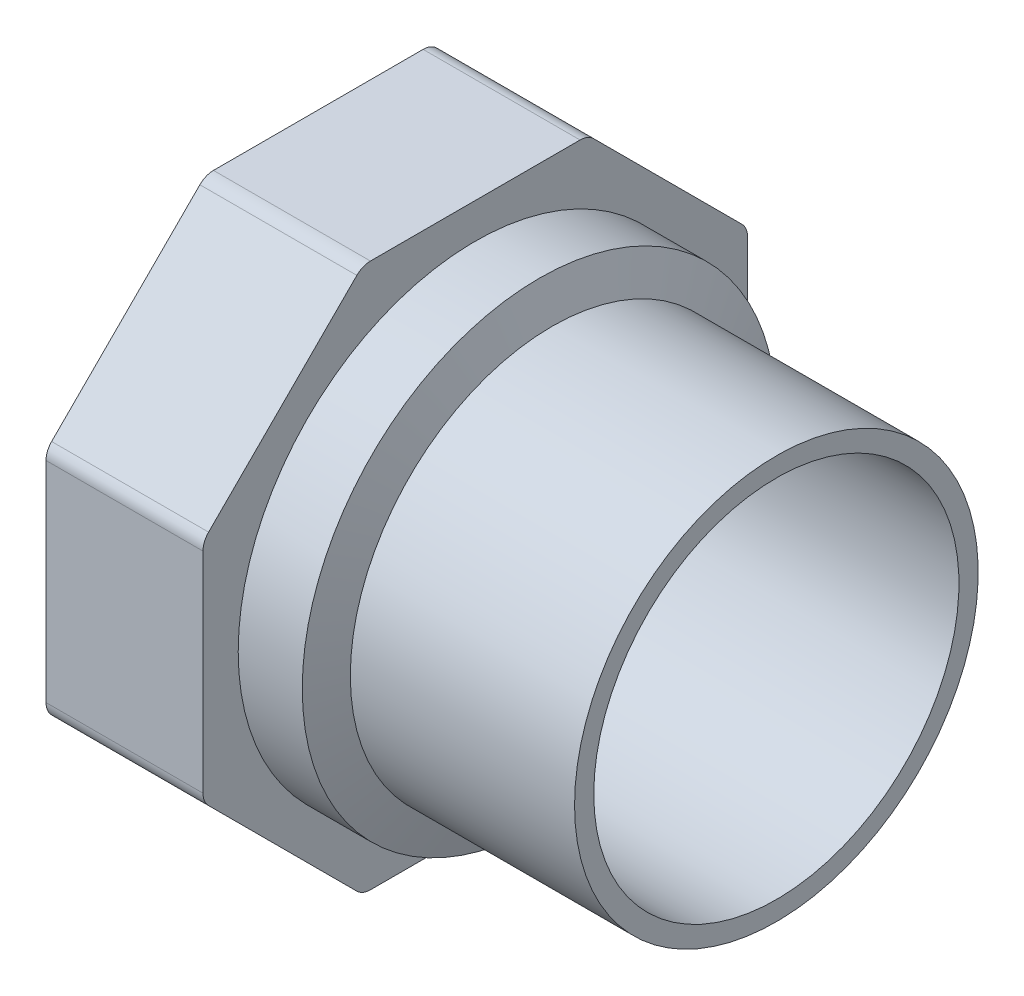
ISO-10303-21;
HEADER;
FILE_DESCRIPTION(('STEP AP214'),'2;1');
FILE_NAME('part.step','',(''),(''),'','','');
FILE_SCHEMA(('AUTOMOTIVE_DESIGN { 1 0 10303 214 1 1 1 1 }'));
ENDSEC;
DATA;
#1=APPLICATION_CONTEXT('core data for automotive mechanical design processes');
#2=APPLICATION_PROTOCOL_DEFINITION('international standard','automotive_design',2000,#1);
#3=PRODUCT_CONTEXT('',#1,'mechanical');
#4=PRODUCT('Part','Part','',(#3));
#5=PRODUCT_RELATED_PRODUCT_CATEGORY('part','',(#4));
#6=PRODUCT_DEFINITION_FORMATION('','',#4);
#7=PRODUCT_DEFINITION_CONTEXT('part definition',#1,'design');
#8=PRODUCT_DEFINITION('design','',#6,#7);
#9=PRODUCT_DEFINITION_SHAPE('','',#8);
#10=(LENGTH_UNIT() NAMED_UNIT(*) SI_UNIT(.MILLI.,.METRE.));
#11=(NAMED_UNIT(*) PLANE_ANGLE_UNIT() SI_UNIT($,.RADIAN.));
#12=(NAMED_UNIT(*) SI_UNIT($,.STERADIAN.) SOLID_ANGLE_UNIT());
#13=UNCERTAINTY_MEASURE_WITH_UNIT(LENGTH_MEASURE(1.E-05),#10,'distance_accuracy_value','');
#14=(GEOMETRIC_REPRESENTATION_CONTEXT(3) GLOBAL_UNCERTAINTY_ASSIGNED_CONTEXT((#13)) GLOBAL_UNIT_ASSIGNED_CONTEXT((#10,
#11,#12)) REPRESENTATION_CONTEXT('',''));
#15=CARTESIAN_POINT('',(0.,0.,0.));
#16=DIRECTION('',(0.,0.,1.));
#17=DIRECTION('',(1.,0.,0.));
#18=AXIS2_PLACEMENT_3D('',#15,#16,#17);
#19=CARTESIAN_POINT('',(-35.,0.,0.));
#20=DIRECTION('',(-1.,0.,0.));
#21=DIRECTION('',(0.,0.,1.));
#22=AXIS2_PLACEMENT_3D('',#19,#20,#21);
#23=CYLINDRICAL_SURFACE('',#22,31.5);
#24=CARTESIAN_POINT('',(-35.,0.,0.));
#25=DIRECTION('',(1.,0.,0.));
#26=DIRECTION('',(0.,1.,0.));
#27=AXIS2_PLACEMENT_3D('',#24,#25,#26);
#28=CIRCLE('',#27,31.5);
#29=CARTESIAN_POINT('',(-35.,31.5,0.));
#30=VERTEX_POINT('',#29);
#31=EDGE_CURVE('E193',#30,#30,#28,.F.);
#32=ORIENTED_EDGE('',*,*,#31,.F.);
#33=EDGE_LOOP('',(#32));
#34=FACE_BOUND('',#33,.T.);
#35=CARTESIAN_POINT('',(0.,0.,0.));
#36=DIRECTION('',(-1.,0.,0.));
#37=DIRECTION('',(0.,0.,1.));
#38=AXIS2_PLACEMENT_3D('',#35,#36,#37);
#39=CIRCLE('',#38,31.5);
#40=CARTESIAN_POINT('',(0.,0.,31.5));
#41=VERTEX_POINT('',#40);
#42=EDGE_CURVE('E18',#41,#41,#39,.F.);
#43=ORIENTED_EDGE('',*,*,#42,.F.);
#44=EDGE_LOOP('',(#43));
#45=FACE_BOUND('',#44,.T.);
#46=ADVANCED_FACE('F15',(#34,#45),#23,.T.);
#47=CARTESIAN_POINT('',(-35.,0.,0.));
#48=DIRECTION('',(-1.,0.,0.));
#49=DIRECTION('',(0.,0.,1.));
#50=AXIS2_PLACEMENT_3D('',#47,#48,#49);
#51=CONICAL_SURFACE('',#50,31.5,1.22202532321099);
#52=CARTESIAN_POINT('',(-37.,0.,0.));
#53=DIRECTION('',(-1.,0.,0.));
#54=DIRECTION('',(0.,1.,0.));
#55=AXIS2_PLACEMENT_3D('',#52,#53,#54);
#56=CIRCLE('',#55,37.);
#57=CARTESIAN_POINT('',(-37.,37.,0.));
#58=VERTEX_POINT('',#57);
#59=EDGE_CURVE('E189',#58,#58,#56,.T.);
#60=ORIENTED_EDGE('',*,*,#59,.F.);
#61=EDGE_LOOP('',(#60));
#62=FACE_BOUND('',#61,.T.);
#63=ORIENTED_EDGE('',*,*,#31,.T.);
#64=EDGE_LOOP('',(#63));
#65=FACE_BOUND('',#64,.T.);
#66=ADVANCED_FACE('F268',(#62,#65),#51,.T.);
#67=CARTESIAN_POINT('',(0.,31.5,31.8780010540613));
#68=DIRECTION('',(1.,0.,0.));
#69=DIRECTION('',(0.,-1.,0.));
#70=AXIS2_PLACEMENT_3D('',#67,#68,#69);
#71=PLANE('',#70);
#72=CARTESIAN_POINT('',(0.,0.,0.));
#73=DIRECTION('',(-1.,0.,0.));
#74=DIRECTION('',(0.,0.,1.));
#75=AXIS2_PLACEMENT_3D('',#72,#73,#74);
#76=CIRCLE('',#75,28.5);
#77=CARTESIAN_POINT('',(0.,0.,28.5));
#78=VERTEX_POINT('',#77);
#79=EDGE_CURVE('E192',#78,#78,#76,.F.);
#80=ORIENTED_EDGE('',*,*,#79,.F.);
#81=EDGE_LOOP('',(#80));
#82=FACE_BOUND('',#81,.T.);
#83=ORIENTED_EDGE('',*,*,#42,.T.);
#84=EDGE_LOOP('',(#83));
#85=FACE_BOUND('',#84,.T.);
#86=ADVANCED_FACE('F264',(#82,#85),#71,.T.);
#87=CARTESIAN_POINT('',(-47.,0.,0.));
#88=DIRECTION('',(-1.,0.,0.));
#89=DIRECTION('',(0.,0.,1.));
#90=AXIS2_PLACEMENT_3D('',#87,#88,#89);
#91=CYLINDRICAL_SURFACE('',#90,37.);
#92=CARTESIAN_POINT('',(-47.,0.,0.));
#93=DIRECTION('',(-1.,0.,0.));
#94=DIRECTION('',(0.,0.,1.));
#95=AXIS2_PLACEMENT_3D('',#92,#93,#94);
#96=CIRCLE('',#95,37.);
#97=CARTESIAN_POINT('',(-47.,0.,37.));
#98=VERTEX_POINT('',#97);
#99=EDGE_CURVE('E188',#98,#98,#96,.T.);
#100=ORIENTED_EDGE('',*,*,#99,.F.);
#101=EDGE_LOOP('',(#100));
#102=FACE_BOUND('',#101,.T.);
#103=ORIENTED_EDGE('',*,*,#59,.T.);
#104=EDGE_LOOP('',(#103));
#105=FACE_BOUND('',#104,.T.);
#106=ADVANCED_FACE('F267',(#102,#105),#91,.T.);
#107=CARTESIAN_POINT('',(0.,0.,0.));
#108=DIRECTION('',(-1.,0.,0.));
#109=DIRECTION('',(0.,0.,1.));
#110=AXIS2_PLACEMENT_3D('',#107,#108,#109);
#111=CYLINDRICAL_SURFACE('',#110,28.5);
#112=ORIENTED_EDGE('',*,*,#79,.T.);
#113=EDGE_LOOP('',(#112));
#114=FACE_BOUND('',#113,.T.);
#115=CARTESIAN_POINT('',(-47.7694157147741,0.,0.));
#116=DIRECTION('',(1.,0.,0.));
#117=DIRECTION('',(0.,1.,0.));
#118=AXIS2_PLACEMENT_3D('',#115,#116,#117);
#119=CIRCLE('',#118,28.5);
#120=CARTESIAN_POINT('',(-47.7694157147741,28.5,0.));
#121=VERTEX_POINT('',#120);
#122=EDGE_CURVE('E135',#121,#121,#119,.T.);
#123=ORIENTED_EDGE('',*,*,#122,.F.);
#124=EDGE_LOOP('',(#123));
#125=FACE_BOUND('',#124,.T.);
#126=ADVANCED_FACE('F261',(#114,#125),#111,.F.);
#127=CARTESIAN_POINT('',(-47.,42.5,42.5));
#128=DIRECTION('',(1.,0.,0.));
#129=DIRECTION('',(0.,-1.,0.));
#130=AXIS2_PLACEMENT_3D('',#127,#128,#129);
#131=PLANE('',#130);
#132=ORIENTED_EDGE('',*,*,#99,.T.);
#133=EDGE_LOOP('',(#132));
#134=FACE_BOUND('',#133,.T.);
#135=CARTESIAN_POINT('',(-47.,16.3614357137373,39.5));
#136=DIRECTION('',(1.,0.,0.));
#137=DIRECTION('',(0.,0.,-1.));
#138=AXIS2_PLACEMENT_3D('',#135,#136,#137);
#139=CIRCLE('',#138,3.00000000000001);
#140=CARTESIAN_POINT('',(-47.,16.3614357137373,42.5));
#141=VERTEX_POINT('',#140);
#142=CARTESIAN_POINT('',(-47.,18.4827560572969,41.6213203435597));
#143=VERTEX_POINT('',#142);
#144=EDGE_CURVE('E254',#141,#143,#139,.F.);
#145=ORIENTED_EDGE('',*,*,#144,.F.);
#146=DIRECTION('',(0.,1.,0.));
#147=VECTOR('',#146,1.);
#148=CARTESIAN_POINT('',(-47.,0.,42.5));
#149=LINE('',#148,#147);
#150=CARTESIAN_POINT('',(-47.,-16.3614357137373,42.5));
#151=VERTEX_POINT('',#150);
#152=EDGE_CURVE('E132',#151,#141,#149,.T.);
#153=ORIENTED_EDGE('',*,*,#152,.F.);
#154=CARTESIAN_POINT('',(-47.,-16.3614357137373,39.5));
#155=DIRECTION('',(1.,0.,0.));
#156=DIRECTION('',(0.,0.,-1.));
#157=AXIS2_PLACEMENT_3D('',#154,#155,#156);
#158=CIRCLE('',#157,3.00000000000002);
#159=CARTESIAN_POINT('',(-47.,-18.4827560572969,41.6213203435597));
#160=VERTEX_POINT('',#159);
#161=EDGE_CURVE('E126',#160,#151,#158,.F.);
#162=ORIENTED_EDGE('',*,*,#161,.F.);
#163=DIRECTION('',(0.,0.707106781186547,0.707106781186548));
#164=VECTOR('',#163,1.);
#165=CARTESIAN_POINT('',(-47.,-30.0520382004283,30.0520382004283));
#166=LINE('',#165,#164);
#167=CARTESIAN_POINT('',(-47.,-41.6213203435597,18.4827560572969));
#168=VERTEX_POINT('',#167);
#169=EDGE_CURVE('E130',#168,#160,#166,.T.);
#170=ORIENTED_EDGE('',*,*,#169,.F.);
#171=CARTESIAN_POINT('',(-47.,-39.5,16.3614357137372));
#172=DIRECTION('',(1.,0.,0.));
#173=DIRECTION('',(0.,0.,-1.));
#174=AXIS2_PLACEMENT_3D('',#171,#172,#173);
#175=CIRCLE('',#174,2.99999999999999);
#176=CARTESIAN_POINT('',(-47.,-42.5,16.3614357137372));
#177=VERTEX_POINT('',#176);
#178=EDGE_CURVE('E149',#177,#168,#175,.F.);
#179=ORIENTED_EDGE('',*,*,#178,.F.);
#180=DIRECTION('',(0.,0.,1.));
#181=VECTOR('',#180,1.);
#182=CARTESIAN_POINT('',(-47.,-42.5,0.));
#183=LINE('',#182,#181);
#184=CARTESIAN_POINT('',(-47.,-42.5,-16.3614357137373));
#185=VERTEX_POINT('',#184);
#186=EDGE_CURVE('E154',#185,#177,#183,.T.);
#187=ORIENTED_EDGE('',*,*,#186,.F.);
#188=CARTESIAN_POINT('',(-47.,-39.4999999999999,-16.3614357137373));
#189=DIRECTION('',(1.,0.,0.));
#190=DIRECTION('',(0.,0.,-1.));
#191=AXIS2_PLACEMENT_3D('',#188,#189,#190);
#192=CIRCLE('',#191,3.00000000000007);
#193=CARTESIAN_POINT('',(-47.,-41.6213203435596,-18.4827560572969));
#194=VERTEX_POINT('',#193);
#195=EDGE_CURVE('E239',#194,#185,#192,.F.);
#196=ORIENTED_EDGE('',*,*,#195,.F.);
#197=DIRECTION('',(0.,-0.707106781186548,0.707106781186547));
#198=VECTOR('',#197,1.);
#199=CARTESIAN_POINT('',(-47.,-30.0520382004283,-30.0520382004283));
#200=LINE('',#199,#198);
#201=CARTESIAN_POINT('',(-47.,-18.4827560572969,-41.6213203435597));
#202=VERTEX_POINT('',#201);
#203=EDGE_CURVE('E159',#202,#194,#200,.T.);
#204=ORIENTED_EDGE('',*,*,#203,.F.);
#205=CARTESIAN_POINT('',(-47.,-16.3614357137372,-39.5));
#206=DIRECTION('',(1.,0.,0.));
#207=DIRECTION('',(0.,0.,-1.));
#208=AXIS2_PLACEMENT_3D('',#205,#206,#207);
#209=CIRCLE('',#208,2.99999999999999);
#210=CARTESIAN_POINT('',(-47.,-16.3614357137372,-42.5));
#211=VERTEX_POINT('',#210);
#212=EDGE_CURVE('E242',#211,#202,#209,.F.);
#213=ORIENTED_EDGE('',*,*,#212,.F.);
#214=DIRECTION('',(0.,-1.,0.));
#215=VECTOR('',#214,1.);
#216=CARTESIAN_POINT('',(-47.,0.,-42.5));
#217=LINE('',#216,#215);
#218=CARTESIAN_POINT('',(-47.,16.3614357137373,-42.5));
#219=VERTEX_POINT('',#218);
#220=EDGE_CURVE('E164',#219,#211,#217,.T.);
#221=ORIENTED_EDGE('',*,*,#220,.F.);
#222=CARTESIAN_POINT('',(-47.,16.3614357137373,-39.5));
#223=DIRECTION('',(1.,0.,0.));
#224=DIRECTION('',(0.,0.,-1.));
#225=AXIS2_PLACEMENT_3D('',#222,#223,#224);
#226=CIRCLE('',#225,3.);
#227=CARTESIAN_POINT('',(-47.,18.4827560572969,-41.6213203435596));
#228=VERTEX_POINT('',#227);
#229=EDGE_CURVE('E245',#228,#219,#226,.F.);
#230=ORIENTED_EDGE('',*,*,#229,.F.);
#231=DIRECTION('',(0.,-0.707106781186547,-0.707106781186548));
#232=VECTOR('',#231,1.);
#233=CARTESIAN_POINT('',(-47.,30.0520382004283,-30.0520382004283));
#234=LINE('',#233,#232);
#235=CARTESIAN_POINT('',(-47.,41.6213203435597,-18.4827560572969));
#236=VERTEX_POINT('',#235);
#237=EDGE_CURVE('E169',#236,#228,#234,.T.);
#238=ORIENTED_EDGE('',*,*,#237,.F.);
#239=CARTESIAN_POINT('',(-47.,39.5,-16.3614357137372));
#240=DIRECTION('',(1.,0.,0.));
#241=DIRECTION('',(0.,0.,-1.));
#242=AXIS2_PLACEMENT_3D('',#239,#240,#241);
#243=CIRCLE('',#242,3.00000000000005);
#244=CARTESIAN_POINT('',(-47.,42.5,-16.3614357137372));
#245=VERTEX_POINT('',#244);
#246=EDGE_CURVE('E248',#245,#236,#243,.F.);
#247=ORIENTED_EDGE('',*,*,#246,.F.);
#248=DIRECTION('',(0.,0.,-1.));
#249=VECTOR('',#248,1.);
#250=CARTESIAN_POINT('',(-47.,42.5,0.));
#251=LINE('',#250,#249);
#252=CARTESIAN_POINT('',(-47.,42.5,16.3614357137372));
#253=VERTEX_POINT('',#252);
#254=EDGE_CURVE('E174',#253,#245,#251,.T.);
#255=ORIENTED_EDGE('',*,*,#254,.F.);
#256=CARTESIAN_POINT('',(-47.,39.5,16.3614357137372));
#257=DIRECTION('',(1.,0.,0.));
#258=DIRECTION('',(0.,0.,-1.));
#259=AXIS2_PLACEMENT_3D('',#256,#257,#258);
#260=CIRCLE('',#259,3.00000000000004);
#261=CARTESIAN_POINT('',(-47.,41.6213203435597,18.4827560572969));
#262=VERTEX_POINT('',#261);
#263=EDGE_CURVE('E251',#262,#253,#260,.F.);
#264=ORIENTED_EDGE('',*,*,#263,.F.);
#265=DIRECTION('',(0.,0.707106781186548,-0.707106781186548));
#266=VECTOR('',#265,1.);
#267=CARTESIAN_POINT('',(-47.,30.0520382004283,30.0520382004283));
#268=LINE('',#267,#266);
#269=EDGE_CURVE('E179',#143,#262,#268,.T.);
#270=ORIENTED_EDGE('',*,*,#269,.F.);
#271=EDGE_LOOP('',(#145,#153,#162,#170,#179,#187,#196,#204,#213,#221,#230,#238,#247,#255,#264,#270));
#272=FACE_BOUND('',#271,.T.);
#273=ADVANCED_FACE('F128',(#134,#272),#131,.T.);
#274=CARTESIAN_POINT('',(-47.,0.,0.));
#275=DIRECTION('',(-1.,0.,0.));
#276=DIRECTION('',(0.,0.,1.));
#277=AXIS2_PLACEMENT_3D('',#274,#275,#276);
#278=CONICAL_SURFACE('',#277,27.1673328898693,1.04719755119659);
#279=ORIENTED_EDGE('',*,*,#122,.T.);
#280=EDGE_LOOP('',(#279));
#281=FACE_BOUND('',#280,.T.);
#282=CARTESIAN_POINT('',(-47.,0.,0.));
#283=DIRECTION('',(1.,0.,0.));
#284=DIRECTION('',(0.,1.,0.));
#285=AXIS2_PLACEMENT_3D('',#282,#283,#284);
#286=CIRCLE('',#285,27.1673328898693);
#287=CARTESIAN_POINT('',(-47.,27.1673328898693,0.));
#288=VERTEX_POINT('',#287);
#289=EDGE_CURVE('E153',#288,#288,#286,.T.);
#290=ORIENTED_EDGE('',*,*,#289,.F.);
#291=EDGE_LOOP('',(#290));
#292=FACE_BOUND('',#291,.T.);
#293=ADVANCED_FACE('F438',(#281,#292),#278,.T.);
#294=CARTESIAN_POINT('',(-47.,-16.3614357137373,39.5));
#295=DIRECTION('',(1.,0.,0.));
#296=DIRECTION('',(0.,0.,-1.));
#297=AXIS2_PLACEMENT_3D('',#294,#295,#296);
#298=CYLINDRICAL_SURFACE('',#297,3.00000000000002);
#299=CARTESIAN_POINT('',(-71.5,-16.3614357137373,39.5));
#300=DIRECTION('',(1.,0.,0.));
#301=DIRECTION('',(0.,0.,-1.));
#302=AXIS2_PLACEMENT_3D('',#299,#300,#301);
#303=CIRCLE('',#302,3.00000000000002);
#304=CARTESIAN_POINT('',(-71.5,-18.4827560572969,41.6213203435597));
#305=VERTEX_POINT('',#304);
#306=CARTESIAN_POINT('',(-71.5,-16.3614357137373,42.5));
#307=VERTEX_POINT('',#306);
#308=EDGE_CURVE('E141',#305,#307,#303,.F.);
#309=ORIENTED_EDGE('',*,*,#308,.F.);
#310=DIRECTION('',(1.,0.,0.));
#311=VECTOR('',#310,1.);
#312=CARTESIAN_POINT('',(-71.5,-18.4827560572969,41.6213203435597));
#313=LINE('',#312,#311);
#314=EDGE_CURVE('E138',#160,#305,#313,.F.);
#315=ORIENTED_EDGE('',*,*,#314,.F.);
#316=ORIENTED_EDGE('',*,*,#161,.T.);
#317=DIRECTION('',(1.,0.,0.));
#318=VECTOR('',#317,1.);
#319=CARTESIAN_POINT('',(-71.5,-16.3614357137373,42.5));
#320=LINE('',#319,#318);
#321=EDGE_CURVE('E185',#307,#151,#320,.T.);
#322=ORIENTED_EDGE('',*,*,#321,.F.);
#323=EDGE_LOOP('',(#309,#315,#316,#322));
#324=FACE_BOUND('',#323,.T.);
#325=ADVANCED_FACE('F139',(#324),#298,.T.);
#326=CARTESIAN_POINT('',(-71.5,16.3614357137372,42.5));
#327=DIRECTION('',(0.,0.,1.));
#328=DIRECTION('',(0.,-1.,0.));
#329=AXIS2_PLACEMENT_3D('',#326,#327,#328);
#330=PLANE('',#329);
#331=DIRECTION('',(0.,1.,0.));
#332=VECTOR('',#331,1.);
#333=CARTESIAN_POINT('',(-71.5,0.,42.5));
#334=LINE('',#333,#332);
#335=CARTESIAN_POINT('',(-71.5,16.3614357137373,42.5));
#336=VERTEX_POINT('',#335);
#337=EDGE_CURVE('E236',#307,#336,#334,.T.);
#338=ORIENTED_EDGE('',*,*,#337,.F.);
#339=ORIENTED_EDGE('',*,*,#321,.T.);
#340=ORIENTED_EDGE('',*,*,#152,.T.);
#341=DIRECTION('',(1.,0.,0.));
#342=VECTOR('',#341,1.);
#343=CARTESIAN_POINT('',(-59.25,16.3614357137372,42.5));
#344=LINE('',#343,#342);
#345=EDGE_CURVE('E183',#336,#141,#344,.T.);
#346=ORIENTED_EDGE('',*,*,#345,.F.);
#347=EDGE_LOOP('',(#338,#339,#340,#346));
#348=FACE_BOUND('',#347,.T.);
#349=ADVANCED_FACE('F387',(#348),#330,.T.);
#350=CARTESIAN_POINT('',(-47.,16.3614357137373,39.5));
#351=DIRECTION('',(1.,0.,0.));
#352=DIRECTION('',(0.,0.,-1.));
#353=AXIS2_PLACEMENT_3D('',#350,#351,#352);
#354=CYLINDRICAL_SURFACE('',#353,3.00000000000001);
#355=CARTESIAN_POINT('',(-71.5,16.3614357137373,39.5));
#356=DIRECTION('',(1.,0.,0.));
#357=DIRECTION('',(0.,0.,-1.));
#358=AXIS2_PLACEMENT_3D('',#355,#356,#357);
#359=CIRCLE('',#358,3.00000000000001);
#360=CARTESIAN_POINT('',(-71.5,18.4827560572969,41.6213203435597));
#361=VERTEX_POINT('',#360);
#362=EDGE_CURVE('E233',#336,#361,#359,.F.);
#363=ORIENTED_EDGE('',*,*,#362,.F.);
#364=ORIENTED_EDGE('',*,*,#345,.T.);
#365=ORIENTED_EDGE('',*,*,#144,.T.);
#366=DIRECTION('',(1.,0.,0.));
#367=VECTOR('',#366,1.);
#368=CARTESIAN_POINT('',(-71.5,18.4827560572969,41.6213203435597));
#369=LINE('',#368,#367);
#370=EDGE_CURVE('E182',#361,#143,#369,.T.);
#371=ORIENTED_EDGE('',*,*,#370,.F.);
#372=EDGE_LOOP('',(#363,#364,#365,#371));
#373=FACE_BOUND('',#372,.T.);
#374=ADVANCED_FACE('F425',(#373),#354,.T.);
#375=CARTESIAN_POINT('',(-71.5,41.6213203435597,18.4827560572969));
#376=DIRECTION('',(0.,0.707106781186547,0.707106781186547));
#377=DIRECTION('',(0.,-0.707106781186547,0.707106781186547));
#378=AXIS2_PLACEMENT_3D('',#375,#376,#377);
#379=PLANE('',#378);
#380=CARTESIAN_POINT('',(-71.5,18.4827560572969,41.6213203435597));
#381=CARTESIAN_POINT('',(-71.5,19.4468629025579,40.6572134982987));
#382=CARTESIAN_POINT('',(-71.5,20.4109697478188,39.6931066530378));
#383=CARTESIAN_POINT('',(-71.5,22.3391834383407,37.7648929625159));
#384=CARTESIAN_POINT('',(-71.5,23.3032902836016,36.8007861172549));
#385=CARTESIAN_POINT('',(-71.5,25.2315039741235,34.872572426733));
#386=CARTESIAN_POINT('',(-71.5,26.1956108193845,33.9084655814721));
#387=CARTESIAN_POINT('',(-71.5,28.1238245099064,31.9802518909502));
#388=CARTESIAN_POINT('',(-71.5,29.0879313551673,31.0161450456892));
#389=CARTESIAN_POINT('',(-71.5,31.0161450456892,29.0879313551673));
#390=CARTESIAN_POINT('',(-71.5,31.9802518909502,28.1238245099064));
#391=CARTESIAN_POINT('',(-71.5,33.9084655814721,26.1956108193845));
#392=CARTESIAN_POINT('',(-71.5,34.872572426733,25.2315039741235));
#393=CARTESIAN_POINT('',(-71.5,36.8007861172549,23.3032902836016));
#394=CARTESIAN_POINT('',(-71.5,37.7648929625159,22.3391834383407));
#395=CARTESIAN_POINT('',(-71.5,39.6931066530378,20.4109697478188));
#396=CARTESIAN_POINT('',(-71.5,40.6572134982987,19.4468629025578));
#397=CARTESIAN_POINT('',(-71.5,41.6213203435597,18.4827560572969));
#398=B_SPLINE_CURVE_WITH_KNOTS('',3,(#380,#381,#382,#383,#384,#385,#386,#387,#388,#389,#390,
#391,#392,#393,#394,#395,#396,#397),.UNSPECIFIED.,.F.,.F.,(4,2,2,2,2,2,2,2,4),(0.,
4.09035892843431,8.18071785686863,12.271076785303,16.3614357137373,20.4517946421716,
24.5421535706059,28.6325124990402,32.7228714274745),.UNSPECIFIED.);
#399=CARTESIAN_POINT('',(-71.5,41.6213203435597,18.4827560572969));
#400=VERTEX_POINT('',#399);
#401=EDGE_CURVE('E232',#361,#400,#398,.T.);
#402=ORIENTED_EDGE('',*,*,#401,.F.);
#403=ORIENTED_EDGE('',*,*,#370,.T.);
#404=ORIENTED_EDGE('',*,*,#269,.T.);
#405=DIRECTION('',(1.,0.,0.));
#406=VECTOR('',#405,1.);
#407=CARTESIAN_POINT('',(-59.25,41.6213203435597,18.4827560572969));
#408=LINE('',#407,#406);
#409=EDGE_CURVE('E178',#400,#262,#408,.T.);
#410=ORIENTED_EDGE('',*,*,#409,.F.);
#411=EDGE_LOOP('',(#402,#403,#404,#410));
#412=FACE_BOUND('',#411,.T.);
#413=ADVANCED_FACE('F423',(#412),#379,.T.);
#414=CARTESIAN_POINT('',(-47.,39.5,16.3614357137372));
#415=DIRECTION('',(1.,0.,0.));
#416=DIRECTION('',(0.,0.,-1.));
#417=AXIS2_PLACEMENT_3D('',#414,#415,#416);
#418=CYLINDRICAL_SURFACE('',#417,3.00000000000004);
#419=CARTESIAN_POINT('',(-71.5,39.5,16.3614357137372));
#420=DIRECTION('',(1.,0.,0.));
#421=DIRECTION('',(0.,0.,-1.));
#422=AXIS2_PLACEMENT_3D('',#419,#420,#421);
#423=CIRCLE('',#422,3.00000000000004);
#424=CARTESIAN_POINT('',(-71.5,42.5,16.3614357137372));
#425=VERTEX_POINT('',#424);
#426=EDGE_CURVE('E229',#400,#425,#423,.F.);
#427=ORIENTED_EDGE('',*,*,#426,.F.);
#428=ORIENTED_EDGE('',*,*,#409,.T.);
#429=ORIENTED_EDGE('',*,*,#263,.T.);
#430=DIRECTION('',(1.,0.,0.));
#431=VECTOR('',#430,1.);
#432=CARTESIAN_POINT('',(-71.5,42.5,16.3614357137373));
#433=LINE('',#432,#431);
#434=EDGE_CURVE('E177',#425,#253,#433,.T.);
#435=ORIENTED_EDGE('',*,*,#434,.F.);
#436=EDGE_LOOP('',(#427,#428,#429,#435));
#437=FACE_BOUND('',#436,.T.);
#438=ADVANCED_FACE('F420',(#437),#418,.T.);
#439=CARTESIAN_POINT('',(-71.5,42.5,-16.3614357137372));
#440=DIRECTION('',(0.,1.,0.));
#441=DIRECTION('',(0.,0.,1.));
#442=AXIS2_PLACEMENT_3D('',#439,#440,#441);
#443=PLANE('',#442);
#444=DIRECTION('',(0.,0.,-1.));
#445=VECTOR('',#444,1.);
#446=CARTESIAN_POINT('',(-71.5,42.5,42.5));
#447=LINE('',#446,#445);
#448=CARTESIAN_POINT('',(-71.5,42.5,-16.3614357137372));
#449=VERTEX_POINT('',#448);
#450=EDGE_CURVE('E228',#425,#449,#447,.T.);
#451=ORIENTED_EDGE('',*,*,#450,.F.);
#452=ORIENTED_EDGE('',*,*,#434,.T.);
#453=ORIENTED_EDGE('',*,*,#254,.T.);
#454=DIRECTION('',(1.,0.,0.));
#455=VECTOR('',#454,1.);
#456=CARTESIAN_POINT('',(-59.25,42.5,-16.3614357137372));
#457=LINE('',#456,#455);
#458=EDGE_CURVE('E173',#449,#245,#457,.T.);
#459=ORIENTED_EDGE('',*,*,#458,.F.);
#460=EDGE_LOOP('',(#451,#452,#453,#459));
#461=FACE_BOUND('',#460,.T.);
#462=ADVANCED_FACE('F417',(#461),#443,.T.);
#463=CARTESIAN_POINT('',(-47.,39.5,-16.3614357137372));
#464=DIRECTION('',(1.,0.,0.));
#465=DIRECTION('',(0.,0.,-1.));
#466=AXIS2_PLACEMENT_3D('',#463,#464,#465);
#467=CYLINDRICAL_SURFACE('',#466,3.00000000000005);
#468=CARTESIAN_POINT('',(-71.5,39.5,-16.3614357137372));
#469=DIRECTION('',(1.,0.,0.));
#470=DIRECTION('',(0.,0.,-1.));
#471=AXIS2_PLACEMENT_3D('',#468,#469,#470);
#472=CIRCLE('',#471,3.00000000000005);
#473=CARTESIAN_POINT('',(-71.5,41.6213203435597,-18.4827560572969));
#474=VERTEX_POINT('',#473);
#475=EDGE_CURVE('E225',#449,#474,#472,.F.);
#476=ORIENTED_EDGE('',*,*,#475,.F.);
#477=ORIENTED_EDGE('',*,*,#458,.T.);
#478=ORIENTED_EDGE('',*,*,#246,.T.);
#479=DIRECTION('',(1.,0.,0.));
#480=VECTOR('',#479,1.);
#481=CARTESIAN_POINT('',(-71.5,41.6213203435597,-18.4827560572969));
#482=LINE('',#481,#480);
#483=EDGE_CURVE('E172',#474,#236,#482,.T.);
#484=ORIENTED_EDGE('',*,*,#483,.F.);
#485=EDGE_LOOP('',(#476,#477,#478,#484));
#486=FACE_BOUND('',#485,.T.);
#487=ADVANCED_FACE('F414',(#486),#467,.T.);
#488=CARTESIAN_POINT('',(-71.5,18.4827560572969,-41.6213203435596));
#489=DIRECTION('',(0.,0.707106781186548,-0.707106781186547));
#490=DIRECTION('',(0.,0.707106781186547,0.707106781186548));
#491=AXIS2_PLACEMENT_3D('',#488,#489,#490);
#492=PLANE('',#491);
#493=CARTESIAN_POINT('',(-71.5,41.6213203435597,-18.4827560572969));
#494=CARTESIAN_POINT('',(-71.5,40.6572134982987,-19.4468629025578));
#495=CARTESIAN_POINT('',(-71.5,39.6931066530378,-20.4109697478188));
#496=CARTESIAN_POINT('',(-71.5,37.7648929625159,-22.3391834383407));
#497=CARTESIAN_POINT('',(-71.5,36.8007861172549,-23.3032902836016));
#498=CARTESIAN_POINT('',(-71.5,34.872572426733,-25.2315039741235));
#499=CARTESIAN_POINT('',(-71.5,33.9084655814721,-26.1956108193845));
#500=CARTESIAN_POINT('',(-71.5,31.9802518909502,-28.1238245099064));
#501=CARTESIAN_POINT('',(-71.5,31.0161450456892,-29.0879313551673));
#502=CARTESIAN_POINT('',(-71.5,29.0879313551673,-31.0161450456892));
#503=CARTESIAN_POINT('',(-71.5,28.1238245099064,-31.9802518909502));
#504=CARTESIAN_POINT('',(-71.5,26.1956108193845,-33.9084655814721));
#505=CARTESIAN_POINT('',(-71.5,25.2315039741235,-34.872572426733));
#506=CARTESIAN_POINT('',(-71.5,23.3032902836016,-36.8007861172549));
#507=CARTESIAN_POINT('',(-71.5,22.3391834383407,-37.7648929625158));
#508=CARTESIAN_POINT('',(-71.5,20.4109697478188,-39.6931066530377));
#509=CARTESIAN_POINT('',(-71.5,19.4468629025579,-40.6572134982987));
#510=CARTESIAN_POINT('',(-71.5,18.4827560572969,-41.6213203435596));
#511=B_SPLINE_CURVE_WITH_KNOTS('',3,(#493,#494,#495,#496,#497,#498,#499,#500,#501,#502,#503,
#504,#505,#506,#507,#508,#509,#510),.UNSPECIFIED.,.F.,.F.,(4,2,2,2,2,2,2,2,4),(0.,
4.09035892843432,8.18071785686863,12.2710767853029,16.3614357137373,20.4517946421716,
24.5421535706059,28.6325124990402,32.7228714274745),.UNSPECIFIED.);
#512=CARTESIAN_POINT('',(-71.5,18.4827560572969,-41.6213203435596));
#513=VERTEX_POINT('',#512);
#514=EDGE_CURVE('E224',#474,#513,#511,.T.);
#515=ORIENTED_EDGE('',*,*,#514,.F.);
#516=ORIENTED_EDGE('',*,*,#483,.T.);
#517=ORIENTED_EDGE('',*,*,#237,.T.);
#518=DIRECTION('',(1.,0.,0.));
#519=VECTOR('',#518,1.);
#520=CARTESIAN_POINT('',(-59.25,18.4827560572969,-41.6213203435596));
#521=LINE('',#520,#519);
#522=EDGE_CURVE('E168',#513,#228,#521,.T.);
#523=ORIENTED_EDGE('',*,*,#522,.F.);
#524=EDGE_LOOP('',(#515,#516,#517,#523));
#525=FACE_BOUND('',#524,.T.);
#526=ADVANCED_FACE('F411',(#525),#492,.T.);
#527=CARTESIAN_POINT('',(-47.,16.3614357137373,-39.5));
#528=DIRECTION('',(1.,0.,0.));
#529=DIRECTION('',(0.,0.,-1.));
#530=AXIS2_PLACEMENT_3D('',#527,#528,#529);
#531=CYLINDRICAL_SURFACE('',#530,3.);
#532=CARTESIAN_POINT('',(-71.5,16.3614357137373,-39.5));
#533=DIRECTION('',(1.,0.,0.));
#534=DIRECTION('',(0.,0.,-1.));
#535=AXIS2_PLACEMENT_3D('',#532,#533,#534);
#536=CIRCLE('',#535,3.);
#537=CARTESIAN_POINT('',(-71.5,16.3614357137373,-42.5));
#538=VERTEX_POINT('',#537);
#539=EDGE_CURVE('E221',#513,#538,#536,.F.);
#540=ORIENTED_EDGE('',*,*,#539,.F.);
#541=ORIENTED_EDGE('',*,*,#522,.T.);
#542=ORIENTED_EDGE('',*,*,#229,.T.);
#543=DIRECTION('',(1.,0.,0.));
#544=VECTOR('',#543,1.);
#545=CARTESIAN_POINT('',(-71.5,16.3614357137373,-42.5));
#546=LINE('',#545,#544);
#547=EDGE_CURVE('E167',#538,#219,#546,.T.);
#548=ORIENTED_EDGE('',*,*,#547,.F.);
#549=EDGE_LOOP('',(#540,#541,#542,#548));
#550=FACE_BOUND('',#549,.T.);
#551=ADVANCED_FACE('F408',(#550),#531,.T.);
#552=CARTESIAN_POINT('',(-71.5,-16.3614357137372,-42.5));
#553=DIRECTION('',(0.,0.,-1.));
#554=DIRECTION('',(0.,1.,0.));
#555=AXIS2_PLACEMENT_3D('',#552,#553,#554);
#556=PLANE('',#555);
#557=DIRECTION('',(0.,-1.,0.));
#558=VECTOR('',#557,1.);
#559=CARTESIAN_POINT('',(-71.5,0.,-42.5));
#560=LINE('',#559,#558);
#561=CARTESIAN_POINT('',(-71.5,-16.3614357137372,-42.5));
#562=VERTEX_POINT('',#561);
#563=EDGE_CURVE('E220',#538,#562,#560,.T.);
#564=ORIENTED_EDGE('',*,*,#563,.F.);
#565=ORIENTED_EDGE('',*,*,#547,.T.);
#566=ORIENTED_EDGE('',*,*,#220,.T.);
#567=DIRECTION('',(1.,0.,0.));
#568=VECTOR('',#567,1.);
#569=CARTESIAN_POINT('',(-59.25,-16.3614357137372,-42.5));
#570=LINE('',#569,#568);
#571=EDGE_CURVE('E163',#562,#211,#570,.T.);
#572=ORIENTED_EDGE('',*,*,#571,.F.);
#573=EDGE_LOOP('',(#564,#565,#566,#572));
#574=FACE_BOUND('',#573,.T.);
#575=ADVANCED_FACE('F405',(#574),#556,.T.);
#576=CARTESIAN_POINT('',(-47.,-16.3614357137372,-39.5));
#577=DIRECTION('',(1.,0.,0.));
#578=DIRECTION('',(0.,0.,-1.));
#579=AXIS2_PLACEMENT_3D('',#576,#577,#578);
#580=CYLINDRICAL_SURFACE('',#579,2.99999999999999);
#581=CARTESIAN_POINT('',(-71.5,-16.3614357137372,-39.5));
#582=DIRECTION('',(1.,0.,0.));
#583=DIRECTION('',(0.,0.,-1.));
#584=AXIS2_PLACEMENT_3D('',#581,#582,#583);
#585=CIRCLE('',#584,2.99999999999999);
#586=CARTESIAN_POINT('',(-71.5,-18.4827560572969,-41.6213203435597));
#587=VERTEX_POINT('',#586);
#588=EDGE_CURVE('E217',#562,#587,#585,.F.);
#589=ORIENTED_EDGE('',*,*,#588,.F.);
#590=ORIENTED_EDGE('',*,*,#571,.T.);
#591=ORIENTED_EDGE('',*,*,#212,.T.);
#592=DIRECTION('',(1.,0.,0.));
#593=VECTOR('',#592,1.);
#594=CARTESIAN_POINT('',(-71.5,-18.4827560572969,-41.6213203435597));
#595=LINE('',#594,#593);
#596=EDGE_CURVE('E162',#587,#202,#595,.T.);
#597=ORIENTED_EDGE('',*,*,#596,.F.);
#598=EDGE_LOOP('',(#589,#590,#591,#597));
#599=FACE_BOUND('',#598,.T.);
#600=ADVANCED_FACE('F402',(#599),#580,.T.);
#601=CARTESIAN_POINT('',(-71.5,-41.6213203435596,-18.4827560572969));
#602=DIRECTION('',(0.,-0.707106781186547,-0.707106781186548));
#603=DIRECTION('',(0.,0.707106781186548,-0.707106781186547));
#604=AXIS2_PLACEMENT_3D('',#601,#602,#603);
#605=PLANE('',#604);
#606=CARTESIAN_POINT('',(-71.5,-18.4827560572969,-41.6213203435597));
#607=CARTESIAN_POINT('',(-71.5,-19.4468629025578,-40.6572134982987));
#608=CARTESIAN_POINT('',(-71.5,-20.4109697478188,-39.6931066530378));
#609=CARTESIAN_POINT('',(-71.5,-22.3391834383407,-37.7648929625159));
#610=CARTESIAN_POINT('',(-71.5,-23.3032902836016,-36.8007861172549));
#611=CARTESIAN_POINT('',(-71.5,-25.2315039741235,-34.872572426733));
#612=CARTESIAN_POINT('',(-71.5,-26.1956108193845,-33.9084655814721));
#613=CARTESIAN_POINT('',(-71.5,-28.1238245099064,-31.9802518909502));
#614=CARTESIAN_POINT('',(-71.5,-29.0879313551673,-31.0161450456892));
#615=CARTESIAN_POINT('',(-71.5,-31.0161450456892,-29.0879313551673));
#616=CARTESIAN_POINT('',(-71.5,-31.9802518909502,-28.1238245099064));
#617=CARTESIAN_POINT('',(-71.5,-33.9084655814721,-26.1956108193845));
#618=CARTESIAN_POINT('',(-71.5,-34.872572426733,-25.2315039741236));
#619=CARTESIAN_POINT('',(-71.5,-36.8007861172549,-23.3032902836017));
#620=CARTESIAN_POINT('',(-71.5,-37.7648929625159,-22.3391834383407));
#621=CARTESIAN_POINT('',(-71.5,-39.6931066530377,-20.4109697478188));
#622=CARTESIAN_POINT('',(-71.5,-40.6572134982987,-19.4468629025579));
#623=CARTESIAN_POINT('',(-71.5,-41.6213203435596,-18.4827560572969));
#624=B_SPLINE_CURVE_WITH_KNOTS('',3,(#606,#607,#608,#609,#610,#611,#612,#613,#614,#615,#616,
#617,#618,#619,#620,#621,#622,#623),.UNSPECIFIED.,.F.,.F.,(4,2,2,2,2,2,2,2,4),(0.,
4.09035892843431,8.18071785686863,12.2710767853029,16.3614357137373,20.4517946421716,
24.5421535706059,28.6325124990402,32.7228714274745),.UNSPECIFIED.);
#625=CARTESIAN_POINT('',(-71.5,-41.6213203435597,-18.4827560572969));
#626=VERTEX_POINT('',#625);
#627=EDGE_CURVE('E216',#587,#626,#624,.T.);
#628=ORIENTED_EDGE('',*,*,#627,.F.);
#629=ORIENTED_EDGE('',*,*,#596,.T.);
#630=ORIENTED_EDGE('',*,*,#203,.T.);
#631=DIRECTION('',(1.,0.,0.));
#632=VECTOR('',#631,1.);
#633=CARTESIAN_POINT('',(-59.25,-41.6213203435597,-18.4827560572969));
#634=LINE('',#633,#632);
#635=EDGE_CURVE('E158',#626,#194,#634,.T.);
#636=ORIENTED_EDGE('',*,*,#635,.F.);
#637=EDGE_LOOP('',(#628,#629,#630,#636));
#638=FACE_BOUND('',#637,.T.);
#639=ADVANCED_FACE('F399',(#638),#605,.T.);
#640=CARTESIAN_POINT('',(-47.,-39.4999999999999,-16.3614357137373));
#641=DIRECTION('',(1.,0.,0.));
#642=DIRECTION('',(0.,0.,-1.));
#643=AXIS2_PLACEMENT_3D('',#640,#641,#642);
#644=CYLINDRICAL_SURFACE('',#643,3.00000000000007);
#645=CARTESIAN_POINT('',(-71.5,-39.4999999999999,-16.3614357137373));
#646=DIRECTION('',(1.,0.,0.));
#647=DIRECTION('',(0.,0.,-1.));
#648=AXIS2_PLACEMENT_3D('',#645,#646,#647);
#649=CIRCLE('',#648,3.00000000000007);
#650=CARTESIAN_POINT('',(-71.5,-42.5,-16.3614357137373));
#651=VERTEX_POINT('',#650);
#652=EDGE_CURVE('E213',#626,#651,#649,.F.);
#653=ORIENTED_EDGE('',*,*,#652,.F.);
#654=ORIENTED_EDGE('',*,*,#635,.T.);
#655=ORIENTED_EDGE('',*,*,#195,.T.);
#656=DIRECTION('',(1.,0.,0.));
#657=VECTOR('',#656,1.);
#658=CARTESIAN_POINT('',(-71.5,-42.5,-16.3614357137373));
#659=LINE('',#658,#657);
#660=EDGE_CURVE('E157',#651,#185,#659,.T.);
#661=ORIENTED_EDGE('',*,*,#660,.F.);
#662=EDGE_LOOP('',(#653,#654,#655,#661));
#663=FACE_BOUND('',#662,.T.);
#664=ADVANCED_FACE('F396',(#663),#644,.T.);
#665=CARTESIAN_POINT('',(-71.5,-42.5,16.3614357137372));
#666=DIRECTION('',(0.,-1.,0.));
#667=DIRECTION('',(0.,0.,-1.));
#668=AXIS2_PLACEMENT_3D('',#665,#666,#667);
#669=PLANE('',#668);
#670=DIRECTION('',(0.,0.,-1.));
#671=VECTOR('',#670,1.);
#672=CARTESIAN_POINT('',(-71.5,-42.5,42.5));
#673=LINE('',#672,#671);
#674=CARTESIAN_POINT('',(-71.5,-42.5,16.3614357137372));
#675=VERTEX_POINT('',#674);
#676=EDGE_CURVE('E212',#651,#675,#673,.F.);
#677=ORIENTED_EDGE('',*,*,#676,.F.);
#678=ORIENTED_EDGE('',*,*,#660,.T.);
#679=ORIENTED_EDGE('',*,*,#186,.T.);
#680=DIRECTION('',(1.,0.,0.));
#681=VECTOR('',#680,1.);
#682=CARTESIAN_POINT('',(-59.25,-42.5,16.3614357137372));
#683=LINE('',#682,#681);
#684=EDGE_CURVE('E146',#675,#177,#683,.T.);
#685=ORIENTED_EDGE('',*,*,#684,.F.);
#686=EDGE_LOOP('',(#677,#678,#679,#685));
#687=FACE_BOUND('',#686,.T.);
#688=ADVANCED_FACE('F393',(#687),#669,.T.);
#689=CARTESIAN_POINT('',(-47.,-39.5,16.3614357137372));
#690=DIRECTION('',(1.,0.,0.));
#691=DIRECTION('',(0.,0.,-1.));
#692=AXIS2_PLACEMENT_3D('',#689,#690,#691);
#693=CYLINDRICAL_SURFACE('',#692,2.99999999999999);
#694=CARTESIAN_POINT('',(-71.5,-39.5,16.3614357137372));
#695=DIRECTION('',(1.,0.,0.));
#696=DIRECTION('',(0.,0.,-1.));
#697=AXIS2_PLACEMENT_3D('',#694,#695,#696);
#698=CIRCLE('',#697,2.99999999999999);
#699=CARTESIAN_POINT('',(-71.5,-41.6213203435597,18.4827560572969));
#700=VERTEX_POINT('',#699);
#701=EDGE_CURVE('E208',#675,#700,#698,.F.);
#702=ORIENTED_EDGE('',*,*,#701,.F.);
#703=ORIENTED_EDGE('',*,*,#684,.T.);
#704=ORIENTED_EDGE('',*,*,#178,.T.);
#705=DIRECTION('',(1.,0.,0.));
#706=VECTOR('',#705,1.);
#707=CARTESIAN_POINT('',(-71.5,-41.6213203435597,18.4827560572969));
#708=LINE('',#707,#706);
#709=EDGE_CURVE('E33',#700,#168,#708,.T.);
#710=ORIENTED_EDGE('',*,*,#709,.F.);
#711=EDGE_LOOP('',(#702,#703,#704,#710));
#712=FACE_BOUND('',#711,.T.);
#713=ADVANCED_FACE('F391',(#712),#693,.T.);
#714=CARTESIAN_POINT('',(-71.5,-18.4827560572969,41.6213203435597));
#715=DIRECTION('',(0.,-0.707106781186548,0.707106781186547));
#716=DIRECTION('',(0.,-0.707106781186547,-0.707106781186548));
#717=AXIS2_PLACEMENT_3D('',#714,#715,#716);
#718=PLANE('',#717);
#719=CARTESIAN_POINT('',(-71.5,-41.6213203435597,18.4827560572969));
#720=CARTESIAN_POINT('',(-71.5,-40.6572134982987,19.4468629025578));
#721=CARTESIAN_POINT('',(-71.5,-39.6931066530378,20.4109697478188));
#722=CARTESIAN_POINT('',(-71.5,-37.7648929625159,22.3391834383407));
#723=CARTESIAN_POINT('',(-71.5,-36.8007861172549,23.3032902836016));
#724=CARTESIAN_POINT('',(-71.5,-34.872572426733,25.2315039741235));
#725=CARTESIAN_POINT('',(-71.5,-33.9084655814721,26.1956108193845));
#726=CARTESIAN_POINT('',(-71.5,-31.9802518909502,28.1238245099064));
#727=CARTESIAN_POINT('',(-71.5,-31.0161450456892,29.0879313551673));
#728=CARTESIAN_POINT('',(-71.5,-29.0879313551673,31.0161450456892));
#729=CARTESIAN_POINT('',(-71.5,-28.1238245099064,31.9802518909502));
#730=CARTESIAN_POINT('',(-71.5,-26.1956108193845,33.9084655814721));
#731=CARTESIAN_POINT('',(-71.5,-25.2315039741235,34.872572426733));
#732=CARTESIAN_POINT('',(-71.5,-23.3032902836016,36.8007861172549));
#733=CARTESIAN_POINT('',(-71.5,-22.3391834383407,37.7648929625159));
#734=CARTESIAN_POINT('',(-71.5,-20.4109697478188,39.6931066530378));
#735=CARTESIAN_POINT('',(-71.5,-19.4468629025579,40.6572134982987));
#736=CARTESIAN_POINT('',(-71.5,-18.4827560572969,41.6213203435597));
#737=B_SPLINE_CURVE_WITH_KNOTS('',3,(#719,#720,#721,#722,#723,#724,#725,#726,#727,#728,#729,
#730,#731,#732,#733,#734,#735,#736),.UNSPECIFIED.,.F.,.F.,(4,2,2,2,2,2,2,2,4),(0.,
4.09035892843432,8.18071785686864,12.271076785303,16.3614357137373,20.4517946421716,
24.5421535706059,28.6325124990402,32.7228714274746),.UNSPECIFIED.);
#738=EDGE_CURVE('E211',#700,#305,#737,.T.);
#739=ORIENTED_EDGE('',*,*,#738,.F.);
#740=ORIENTED_EDGE('',*,*,#709,.T.);
#741=ORIENTED_EDGE('',*,*,#169,.T.);
#742=ORIENTED_EDGE('',*,*,#314,.T.);
#743=EDGE_LOOP('',(#739,#740,#741,#742));
#744=FACE_BOUND('',#743,.T.);
#745=ADVANCED_FACE('F145',(#744),#718,.T.);
#746=CARTESIAN_POINT('',(-69.673130898859,0.,0.));
#747=DIRECTION('',(-1.,0.,0.));
#748=DIRECTION('',(0.,0.,1.));
#749=AXIS2_PLACEMENT_3D('',#746,#747,#748);
#750=CONICAL_SURFACE('',#749,27.873130898859,0.0311192205630593);
#751=ORIENTED_EDGE('',*,*,#289,.T.);
#752=EDGE_LOOP('',(#751));
#753=FACE_BOUND('',#752,.T.);
#754=CARTESIAN_POINT('',(-69.673130898859,0.,0.));
#755=DIRECTION('',(1.,0.,0.));
#756=DIRECTION('',(0.,1.,0.));
#757=AXIS2_PLACEMENT_3D('',#754,#755,#756);
#758=CIRCLE('',#757,27.873130898859);
#759=CARTESIAN_POINT('',(-69.673130898859,27.873130898859,0.));
#760=VERTEX_POINT('',#759);
#761=EDGE_CURVE('E207',#760,#760,#758,.T.);
#762=ORIENTED_EDGE('',*,*,#761,.F.);
#763=EDGE_LOOP('',(#762));
#764=FACE_BOUND('',#763,.T.);
#765=ADVANCED_FACE('F560',(#753,#764),#750,.F.);
#766=CARTESIAN_POINT('',(-71.5,-42.5,42.5));
#767=DIRECTION('',(-1.,0.,0.));
#768=DIRECTION('',(0.,1.,0.));
#769=AXIS2_PLACEMENT_3D('',#766,#767,#768);
#770=PLANE('',#769);
#771=CARTESIAN_POINT('',(-71.5,0.,0.));
#772=DIRECTION('',(-1.,0.,0.));
#773=DIRECTION('',(0.,0.,1.));
#774=AXIS2_PLACEMENT_3D('',#771,#772,#773);
#775=CIRCLE('',#774,37.);
#776=CARTESIAN_POINT('',(-71.5,0.,37.));
#777=VERTEX_POINT('',#776);
#778=EDGE_CURVE('E204',#777,#777,#775,.T.);
#779=ORIENTED_EDGE('',*,*,#778,.F.);
#780=EDGE_LOOP('',(#779));
#781=FACE_BOUND('',#780,.T.);
#782=ORIENTED_EDGE('',*,*,#701,.T.);
#783=ORIENTED_EDGE('',*,*,#738,.T.);
#784=ORIENTED_EDGE('',*,*,#308,.T.);
#785=ORIENTED_EDGE('',*,*,#337,.T.);
#786=ORIENTED_EDGE('',*,*,#362,.T.);
#787=ORIENTED_EDGE('',*,*,#401,.T.);
#788=ORIENTED_EDGE('',*,*,#426,.T.);
#789=ORIENTED_EDGE('',*,*,#450,.T.);
#790=ORIENTED_EDGE('',*,*,#475,.T.);
#791=ORIENTED_EDGE('',*,*,#514,.T.);
#792=ORIENTED_EDGE('',*,*,#539,.T.);
#793=ORIENTED_EDGE('',*,*,#563,.T.);
#794=ORIENTED_EDGE('',*,*,#588,.T.);
#795=ORIENTED_EDGE('',*,*,#627,.T.);
#796=ORIENTED_EDGE('',*,*,#652,.T.);
#797=ORIENTED_EDGE('',*,*,#676,.T.);
#798=EDGE_LOOP('',(#782,#783,#784,#785,#786,#787,#788,#789,#790,#791,#792,#793,#794,#795,#796,#797));
#799=FACE_BOUND('',#798,.T.);
#800=ADVANCED_FACE('F304',(#781,#799),#770,.T.);
#801=CARTESIAN_POINT('',(-71.5,0.,0.));
#802=DIRECTION('',(-1.,0.,0.));
#803=DIRECTION('',(0.,0.,1.));
#804=AXIS2_PLACEMENT_3D('',#801,#802,#803);
#805=CONICAL_SURFACE('',#804,29.7,0.785398163397449);
#806=ORIENTED_EDGE('',*,*,#761,.T.);
#807=EDGE_LOOP('',(#806));
#808=FACE_BOUND('',#807,.T.);
#809=CARTESIAN_POINT('',(-71.5,0.,0.));
#810=DIRECTION('',(-1.,0.,0.));
#811=DIRECTION('',(0.,0.,1.));
#812=AXIS2_PLACEMENT_3D('',#809,#810,#811);
#813=CIRCLE('',#812,29.7);
#814=CARTESIAN_POINT('',(-71.5,0.,29.7));
#815=VERTEX_POINT('',#814);
#816=EDGE_CURVE('E201',#815,#815,#813,.F.);
#817=ORIENTED_EDGE('',*,*,#816,.F.);
#818=EDGE_LOOP('',(#817));
#819=FACE_BOUND('',#818,.T.);
#820=ADVANCED_FACE('F300',(#808,#819),#805,.F.);
#821=CARTESIAN_POINT('',(-75.,0.,0.));
#822=DIRECTION('',(-1.,0.,0.));
#823=DIRECTION('',(0.,0.,1.));
#824=AXIS2_PLACEMENT_3D('',#821,#822,#823);
#825=CYLINDRICAL_SURFACE('',#824,37.);
#826=CARTESIAN_POINT('',(-75.,0.,0.));
#827=DIRECTION('',(-1.,0.,0.));
#828=DIRECTION('',(0.,0.,1.));
#829=AXIS2_PLACEMENT_3D('',#826,#827,#828);
#830=CIRCLE('',#829,37.);
#831=CARTESIAN_POINT('',(-75.,0.,37.));
#832=VERTEX_POINT('',#831);
#833=EDGE_CURVE('E198',#832,#832,#830,.T.);
#834=ORIENTED_EDGE('',*,*,#833,.F.);
#835=EDGE_LOOP('',(#834));
#836=FACE_BOUND('',#835,.T.);
#837=ORIENTED_EDGE('',*,*,#778,.T.);
#838=EDGE_LOOP('',(#837));
#839=FACE_BOUND('',#838,.T.);
#840=ADVANCED_FACE('F296',(#836,#839),#825,.T.);
#841=CARTESIAN_POINT('',(-71.5,-35.,35.4200021082878));
#842=DIRECTION('',(-1.,0.,0.));
#843=DIRECTION('',(0.,1.,0.));
#844=AXIS2_PLACEMENT_3D('',#841,#842,#843);
#845=PLANE('',#844);
#846=ORIENTED_EDGE('',*,*,#816,.T.);
#847=EDGE_LOOP('',(#846));
#848=FACE_BOUND('',#847,.T.);
#849=CARTESIAN_POINT('',(-71.5,0.,0.));
#850=DIRECTION('',(-1.,0.,0.));
#851=DIRECTION('',(0.,0.,1.));
#852=AXIS2_PLACEMENT_3D('',#849,#850,#851);
#853=CIRCLE('',#852,35.);
#854=CARTESIAN_POINT('',(-71.5,0.,35.));
#855=VERTEX_POINT('',#854);
#856=EDGE_CURVE('E24',#855,#855,#853,.F.);
#857=ORIENTED_EDGE('',*,*,#856,.F.);
#858=EDGE_LOOP('',(#857));
#859=FACE_BOUND('',#858,.T.);
#860=ADVANCED_FACE('F289',(#848,#859),#845,.T.);
#861=CARTESIAN_POINT('',(-75.,-37.,37.4440021082557));
#862=DIRECTION('',(-1.,0.,0.));
#863=DIRECTION('',(0.,1.,0.));
#864=AXIS2_PLACEMENT_3D('',#861,#862,#863);
#865=PLANE('',#864);
#866=CARTESIAN_POINT('',(-75.,0.,0.));
#867=DIRECTION('',(-1.,0.,0.));
#868=DIRECTION('',(0.,0.,1.));
#869=AXIS2_PLACEMENT_3D('',#866,#867,#868);
#870=CIRCLE('',#869,35.);
#871=CARTESIAN_POINT('',(-75.,0.,35.));
#872=VERTEX_POINT('',#871);
#873=EDGE_CURVE('E9',#872,#872,#870,.T.);
#874=ORIENTED_EDGE('',*,*,#873,.F.);
#875=EDGE_LOOP('',(#874));
#876=FACE_BOUND('',#875,.T.);
#877=ORIENTED_EDGE('',*,*,#833,.T.);
#878=EDGE_LOOP('',(#877));
#879=FACE_BOUND('',#878,.T.);
#880=ADVANCED_FACE('F283',(#876,#879),#865,.T.);
#881=CARTESIAN_POINT('',(-71.5,0.,0.));
#882=DIRECTION('',(-1.,0.,0.));
#883=DIRECTION('',(0.,0.,1.));
#884=AXIS2_PLACEMENT_3D('',#881,#882,#883);
#885=CYLINDRICAL_SURFACE('',#884,35.);
#886=ORIENTED_EDGE('',*,*,#856,.T.);
#887=EDGE_LOOP('',(#886));
#888=FACE_BOUND('',#887,.T.);
#889=ORIENTED_EDGE('',*,*,#873,.T.);
#890=EDGE_LOOP('',(#889));
#891=FACE_BOUND('',#890,.T.);
#892=ADVANCED_FACE('F281',(#888,#891),#885,.F.);
#893=CLOSED_SHELL('',(#46,#66,#86,#106,#126,#273,#293,#325,#349,#374,#413,#438,#462,#487,#526,
#551,#575,#600,#639,#664,#688,#713,#745,#765,#800,#820,#840,#860,#880,#892));
#894=MANIFOLD_SOLID_BREP('B1',#893);
#895=ADVANCED_BREP_SHAPE_REPRESENTATION('',(#18,#894),#14);
#896=SHAPE_DEFINITION_REPRESENTATION(#9,#895);
ENDSEC;
END-ISO-10303-21;
